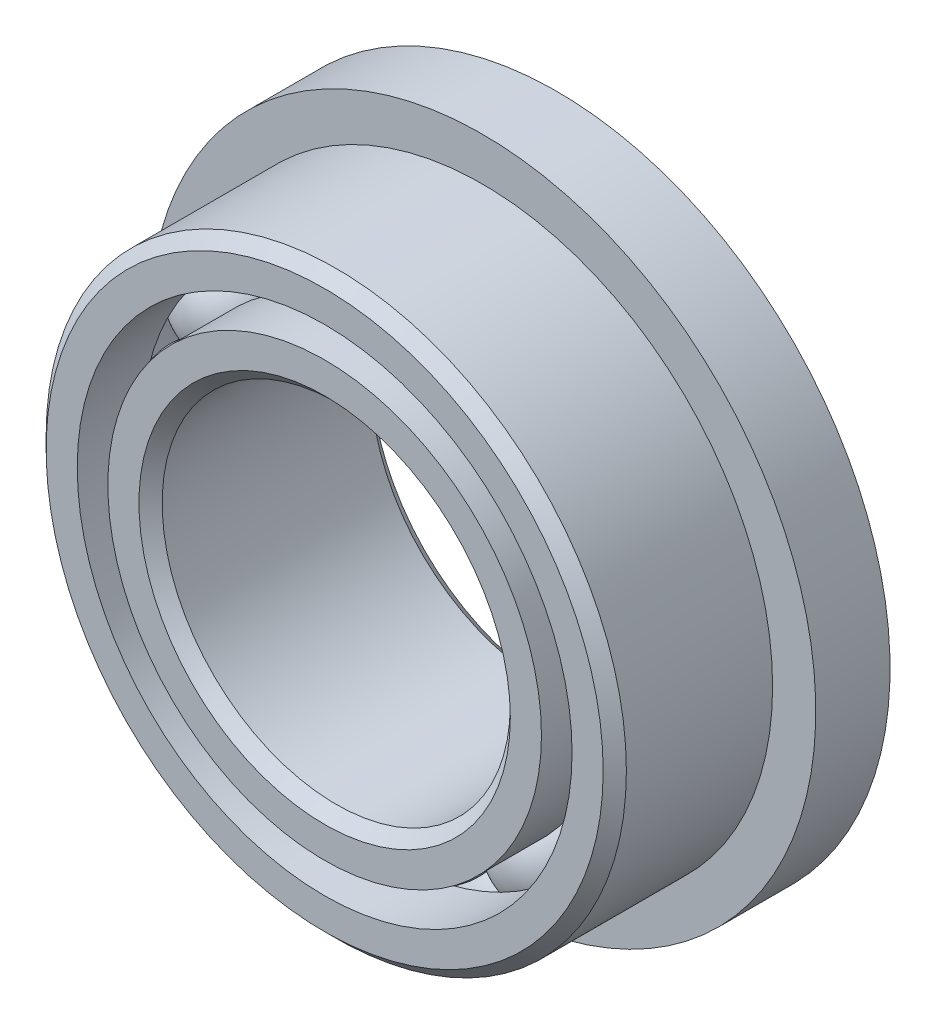
ISO-10303-21;
HEADER;
FILE_DESCRIPTION(('STEP AP214'),'2;1');
FILE_NAME('part.step','',(''),(''),'','','');
FILE_SCHEMA(('AUTOMOTIVE_DESIGN { 1 0 10303 214 1 1 1 1 }'));
ENDSEC;
DATA;
#1=APPLICATION_CONTEXT('core data for automotive mechanical design processes');
#2=APPLICATION_PROTOCOL_DEFINITION('international standard','automotive_design',2000,#1);
#3=PRODUCT_CONTEXT('',#1,'mechanical');
#4=PRODUCT('Part','Part','',(#3));
#5=PRODUCT_RELATED_PRODUCT_CATEGORY('part','',(#4));
#6=PRODUCT_DEFINITION_FORMATION('','',#4);
#7=PRODUCT_DEFINITION_CONTEXT('part definition',#1,'design');
#8=PRODUCT_DEFINITION('design','',#6,#7);
#9=PRODUCT_DEFINITION_SHAPE('','',#8);
#10=(LENGTH_UNIT() NAMED_UNIT(*) SI_UNIT(.MILLI.,.METRE.));
#11=(NAMED_UNIT(*) PLANE_ANGLE_UNIT() SI_UNIT($,.RADIAN.));
#12=(NAMED_UNIT(*) SI_UNIT($,.STERADIAN.) SOLID_ANGLE_UNIT());
#13=UNCERTAINTY_MEASURE_WITH_UNIT(LENGTH_MEASURE(1.E-05),#10,'distance_accuracy_value','');
#14=(GEOMETRIC_REPRESENTATION_CONTEXT(3) GLOBAL_UNCERTAINTY_ASSIGNED_CONTEXT((#13)) GLOBAL_UNIT_ASSIGNED_CONTEXT((#10,
#11,#12)) REPRESENTATION_CONTEXT('',''));
#15=CARTESIAN_POINT('',(0.,0.,0.));
#16=DIRECTION('',(0.,0.,1.));
#17=DIRECTION('',(1.,0.,0.));
#18=AXIS2_PLACEMENT_3D('',#15,#16,#17);
#19=CARTESIAN_POINT('',(-1.58749999999996,2.74963065701561,0.));
#20=DIRECTION('',(0.,0.,1.));
#21=DIRECTION('',(0.499999999999989,-0.866025403784445,0.));
#22=AXIS2_PLACEMENT_3D('',#19,#20,#21);
#23=SPHERICAL_SURFACE('',#22,0.735956624828183);
#24=CARTESIAN_POINT('',(-1.58749999999996,2.74963065701561,0.735956624828182));
#25=VERTEX_POINT('',#24);
#26=VERTEX_LOOP('',#25);
#27=FACE_BOUND('',#26,.T.);
#28=ADVANCED_FACE('F37',(#27),#23,.T.);
#29=CLOSED_SHELL('',(#28));
#30=MANIFOLD_SOLID_BREP('B2',#29);
#31=CARTESIAN_POINT('',(-2.74963065701557,1.58750000000003,0.));
#32=DIRECTION('',(0.,0.,1.));
#33=DIRECTION('',(0.866025403784433,-0.50000000000001,0.));
#34=AXIS2_PLACEMENT_3D('',#31,#32,#33);
#35=SPHERICAL_SURFACE('',#34,0.735956624828183);
#36=CARTESIAN_POINT('',(-2.74963065701557,1.58750000000003,0.735956624828182));
#37=VERTEX_POINT('',#36);
#38=VERTEX_LOOP('',#37);
#39=FACE_BOUND('',#38,.T.);
#40=ADVANCED_FACE('F57',(#39),#35,.T.);
#41=CLOSED_SHELL('',(#40));
#42=MANIFOLD_SOLID_BREP('B6',#41);
#43=CARTESIAN_POINT('',(-3.175,0.,0.));
#44=DIRECTION('',(0.,0.,1.));
#45=DIRECTION('',(1.,0.,0.));
#46=AXIS2_PLACEMENT_3D('',#43,#44,#45);
#47=SPHERICAL_SURFACE('',#46,0.735956624828183);
#48=CARTESIAN_POINT('',(-3.175,0.,0.735956624828182));
#49=VERTEX_POINT('',#48);
#50=VERTEX_LOOP('',#49);
#51=FACE_BOUND('',#50,.T.);
#52=ADVANCED_FACE('F77',(#51),#47,.T.);
#53=CLOSED_SHELL('',(#52));
#54=MANIFOLD_SOLID_BREP('B33',#53);
#55=CARTESIAN_POINT('',(-2.74963065701561,-1.58749999999997,0.));
#56=DIRECTION('',(0.,0.,1.));
#57=DIRECTION('',(0.866025403784443,0.499999999999992,0.));
#58=AXIS2_PLACEMENT_3D('',#55,#56,#57);
#59=SPHERICAL_SURFACE('',#58,0.735956624828183);
#60=CARTESIAN_POINT('',(-2.74963065701561,-1.58749999999997,0.735956624828182));
#61=VERTEX_POINT('',#60);
#62=VERTEX_LOOP('',#61);
#63=FACE_BOUND('',#62,.T.);
#64=ADVANCED_FACE('F97',(#63),#59,.T.);
#65=CLOSED_SHELL('',(#64));
#66=MANIFOLD_SOLID_BREP('B53',#65);
#67=CARTESIAN_POINT('',(-1.58750000000002,-2.74963065701558,0.));
#68=DIRECTION('',(0.,0.,1.));
#69=DIRECTION('',(0.500000000000007,0.866025403784435,0.));
#70=AXIS2_PLACEMENT_3D('',#67,#68,#69);
#71=SPHERICAL_SURFACE('',#70,0.735956624828183);
#72=CARTESIAN_POINT('',(-1.58750000000002,-2.74963065701558,0.735956624828182));
#73=VERTEX_POINT('',#72);
#74=VERTEX_LOOP('',#73);
#75=FACE_BOUND('',#74,.T.);
#76=ADVANCED_FACE('F117',(#75),#71,.T.);
#77=CLOSED_SHELL('',(#76));
#78=MANIFOLD_SOLID_BREP('B73',#77);
#79=CARTESIAN_POINT('',(0.,-3.175,0.));
#80=DIRECTION('',(0.,0.,1.));
#81=DIRECTION('',(0.,1.,0.));
#82=AXIS2_PLACEMENT_3D('',#79,#80,#81);
#83=SPHERICAL_SURFACE('',#82,0.735956624828183);
#84=CARTESIAN_POINT('',(0.,-3.175,0.735956624828182));
#85=VERTEX_POINT('',#84);
#86=VERTEX_LOOP('',#85);
#87=FACE_BOUND('',#86,.T.);
#88=ADVANCED_FACE('F137',(#87),#83,.T.);
#89=CLOSED_SHELL('',(#88));
#90=MANIFOLD_SOLID_BREP('B93',#89);
#91=CARTESIAN_POINT('',(1.58749999999998,-2.7496306570156,0.));
#92=DIRECTION('',(0.,0.,1.));
#93=DIRECTION('',(-0.499999999999995,0.866025403784442,0.));
#94=AXIS2_PLACEMENT_3D('',#91,#92,#93);
#95=SPHERICAL_SURFACE('',#94,0.735956624828183);
#96=CARTESIAN_POINT('',(1.58749999999998,-2.7496306570156,0.735956624828182));
#97=VERTEX_POINT('',#96);
#98=VERTEX_LOOP('',#97);
#99=FACE_BOUND('',#98,.T.);
#100=ADVANCED_FACE('F157',(#99),#95,.T.);
#101=CLOSED_SHELL('',(#100));
#102=MANIFOLD_SOLID_BREP('B113',#101);
#103=CARTESIAN_POINT('',(2.74963065701559,-1.58750000000001,0.));
#104=DIRECTION('',(0.,0.,1.));
#105=DIRECTION('',(-0.866025403784436,0.500000000000004,0.));
#106=AXIS2_PLACEMENT_3D('',#103,#104,#105);
#107=SPHERICAL_SURFACE('',#106,0.735956624828183);
#108=CARTESIAN_POINT('',(2.74963065701559,-1.58750000000001,0.735956624828182));
#109=VERTEX_POINT('',#108);
#110=VERTEX_LOOP('',#109);
#111=FACE_BOUND('',#110,.T.);
#112=ADVANCED_FACE('F177',(#111),#107,.T.);
#113=CLOSED_SHELL('',(#112));
#114=MANIFOLD_SOLID_BREP('B133',#113);
#115=CARTESIAN_POINT('',(3.175,0.,0.));
#116=DIRECTION('',(0.,0.,1.));
#117=DIRECTION('',(-1.,0.,0.));
#118=AXIS2_PLACEMENT_3D('',#115,#116,#117);
#119=SPHERICAL_SURFACE('',#118,0.735956624828183);
#120=CARTESIAN_POINT('',(3.175,0.,0.735956624828182));
#121=VERTEX_POINT('',#120);
#122=VERTEX_LOOP('',#121);
#123=FACE_BOUND('',#122,.T.);
#124=ADVANCED_FACE('F197',(#123),#119,.T.);
#125=CLOSED_SHELL('',(#124));
#126=MANIFOLD_SOLID_BREP('B153',#125);
#127=CARTESIAN_POINT('',(2.7496306570156,1.58749999999999,0.));
#128=DIRECTION('',(0.,0.,1.));
#129=DIRECTION('',(-0.86602540378444,-0.499999999999998,0.));
#130=AXIS2_PLACEMENT_3D('',#127,#128,#129);
#131=SPHERICAL_SURFACE('',#130,0.735956624828183);
#132=CARTESIAN_POINT('',(2.7496306570156,1.58749999999999,0.735956624828182));
#133=VERTEX_POINT('',#132);
#134=VERTEX_LOOP('',#133);
#135=FACE_BOUND('',#134,.T.);
#136=ADVANCED_FACE('F217',(#135),#131,.T.);
#137=CLOSED_SHELL('',(#136));
#138=MANIFOLD_SOLID_BREP('B173',#137);
#139=CARTESIAN_POINT('',(1.5875,2.74963065701559,0.));
#140=DIRECTION('',(0.,0.,1.));
#141=DIRECTION('',(-0.500000000000001,-0.866025403784438,0.));
#142=AXIS2_PLACEMENT_3D('',#139,#140,#141);
#143=SPHERICAL_SURFACE('',#142,0.735956624828183);
#144=CARTESIAN_POINT('',(1.5875,2.74963065701559,0.735956624828182));
#145=VERTEX_POINT('',#144);
#146=VERTEX_LOOP('',#145);
#147=FACE_BOUND('',#146,.T.);
#148=ADVANCED_FACE('F237',(#147),#143,.T.);
#149=CLOSED_SHELL('',(#148));
#150=MANIFOLD_SOLID_BREP('B193',#149);
#151=CARTESIAN_POINT('',(0.,3.175,0.));
#152=DIRECTION('',(0.,0.,1.));
#153=DIRECTION('',(0.,-1.,0.));
#154=AXIS2_PLACEMENT_3D('',#151,#152,#153);
#155=SPHERICAL_SURFACE('',#154,0.735956624828183);
#156=CARTESIAN_POINT('',(0.,3.175,0.735956624828182));
#157=VERTEX_POINT('',#156);
#158=VERTEX_LOOP('',#157);
#159=FACE_BOUND('',#158,.T.);
#160=ADVANCED_FACE('F260',(#159),#155,.T.);
#161=CLOSED_SHELL('',(#160));
#162=MANIFOLD_SOLID_BREP('B213',#161);
#163=CARTESIAN_POINT('',(0.,2.96565934065934,1.5875));
#164=DIRECTION('',(0.,0.,-1.));
#165=DIRECTION('',(-1.,0.,0.));
#166=AXIS2_PLACEMENT_3D('',#163,#164,#165);
#167=PLANE('',#166);
#168=CARTESIAN_POINT('',(0.,0.,1.5875));
#169=DIRECTION('',(0.,0.,1.));
#170=DIRECTION('',(1.,0.,0.));
#171=AXIS2_PLACEMENT_3D('',#168,#169,#170);
#172=CIRCLE('',#171,2.54);
#173=CARTESIAN_POINT('',(2.54,0.,1.5875));
#174=VERTEX_POINT('',#173);
#175=EDGE_CURVE('E308',#174,#174,#172,.T.);
#176=ORIENTED_EDGE('',*,*,#175,.F.);
#177=EDGE_LOOP('',(#176));
#178=FACE_BOUND('',#177,.T.);
#179=CARTESIAN_POINT('',(0.,0.,1.5875));
#180=DIRECTION('',(0.,0.,1.));
#181=DIRECTION('',(1.,0.,0.));
#182=AXIS2_PLACEMENT_3D('',#179,#180,#181);
#183=CIRCLE('',#182,2.96565934065934);
#184=CARTESIAN_POINT('',(2.96565934065934,0.,1.5875));
#185=VERTEX_POINT('',#184);
#186=EDGE_CURVE('E259',#185,#185,#183,.T.);
#187=ORIENTED_EDGE('',*,*,#186,.T.);
#188=EDGE_LOOP('',(#187));
#189=FACE_BOUND('',#188,.T.);
#190=ADVANCED_FACE('F280',(#178,#189),#167,.F.);
#191=CARTESIAN_POINT('',(0.,0.,1.5875));
#192=DIRECTION('',(0.,0.,1.));
#193=DIRECTION('',(1.,0.,0.));
#194=AXIS2_PLACEMENT_3D('',#191,#192,#193);
#195=CYLINDRICAL_SURFACE('',#194,2.96565934065934);
#196=ORIENTED_EDGE('',*,*,#186,.F.);
#197=EDGE_LOOP('',(#196));
#198=FACE_BOUND('',#197,.T.);
#199=CARTESIAN_POINT('',(0.,0.,0.705555555555555));
#200=DIRECTION('',(0.,0.,1.));
#201=DIRECTION('',(1.,0.,0.));
#202=AXIS2_PLACEMENT_3D('',#199,#200,#201);
#203=CIRCLE('',#202,2.96565934065934);
#204=CARTESIAN_POINT('',(2.96565934065934,0.,0.705555555555555));
#205=VERTEX_POINT('',#204);
#206=EDGE_CURVE('E286',#205,#205,#203,.T.);
#207=ORIENTED_EDGE('',*,*,#206,.T.);
#208=EDGE_LOOP('',(#207));
#209=FACE_BOUND('',#208,.T.);
#210=ADVANCED_FACE('F315',(#198,#209),#195,.T.);
#211=CARTESIAN_POINT('',(0.,0.,0.));
#212=DIRECTION('',(0.,0.,1.));
#213=DIRECTION('',(1.,0.,0.));
#214=AXIS2_PLACEMENT_3D('',#211,#212,#213);
#215=TOROIDAL_SURFACE('',#214,3.175,0.735956624828183);
#216=ORIENTED_EDGE('',*,*,#206,.F.);
#217=EDGE_LOOP('',(#216));
#218=FACE_BOUND('',#217,.T.);
#219=CARTESIAN_POINT('',(0.,0.,-0.705555555555556));
#220=DIRECTION('',(0.,0.,1.));
#221=DIRECTION('',(1.,0.,0.));
#222=AXIS2_PLACEMENT_3D('',#219,#220,#221);
#223=CIRCLE('',#222,2.96565934065934);
#224=CARTESIAN_POINT('',(2.96565934065934,0.,-0.705555555555556));
#225=VERTEX_POINT('',#224);
#226=EDGE_CURVE('E290',#225,#225,#223,.T.);
#227=ORIENTED_EDGE('',*,*,#226,.T.);
#228=EDGE_LOOP('',(#227));
#229=FACE_BOUND('',#228,.T.);
#230=ADVANCED_FACE('F319',(#218,#229),#215,.F.);
#231=CARTESIAN_POINT('',(0.,0.,1.5875));
#232=DIRECTION('',(0.,0.,1.));
#233=DIRECTION('',(1.,0.,0.));
#234=AXIS2_PLACEMENT_3D('',#231,#232,#233);
#235=CYLINDRICAL_SURFACE('',#234,2.96565934065934);
#236=ORIENTED_EDGE('',*,*,#226,.F.);
#237=EDGE_LOOP('',(#236));
#238=FACE_BOUND('',#237,.T.);
#239=CARTESIAN_POINT('',(0.,0.,-1.5875));
#240=DIRECTION('',(0.,0.,1.));
#241=DIRECTION('',(1.,0.,0.));
#242=AXIS2_PLACEMENT_3D('',#239,#240,#241);
#243=CIRCLE('',#242,2.96565934065934);
#244=CARTESIAN_POINT('',(2.96565934065934,0.,-1.5875));
#245=VERTEX_POINT('',#244);
#246=EDGE_CURVE('E294',#245,#245,#243,.T.);
#247=ORIENTED_EDGE('',*,*,#246,.T.);
#248=EDGE_LOOP('',(#247));
#249=FACE_BOUND('',#248,.T.);
#250=ADVANCED_FACE('F324',(#238,#249),#235,.T.);
#251=CARTESIAN_POINT('',(0.,2.54,-1.5875));
#252=DIRECTION('',(0.,0.,1.));
#253=DIRECTION('',(1.,0.,0.));
#254=AXIS2_PLACEMENT_3D('',#251,#252,#253);
#255=PLANE('',#254);
#256=ORIENTED_EDGE('',*,*,#246,.F.);
#257=EDGE_LOOP('',(#256));
#258=FACE_BOUND('',#257,.T.);
#259=CARTESIAN_POINT('',(0.,0.,-1.5875));
#260=DIRECTION('',(0.,0.,1.));
#261=DIRECTION('',(1.,0.,0.));
#262=AXIS2_PLACEMENT_3D('',#259,#260,#261);
#263=CIRCLE('',#262,2.54);
#264=CARTESIAN_POINT('',(2.54,0.,-1.5875));
#265=VERTEX_POINT('',#264);
#266=EDGE_CURVE('E299',#265,#265,#263,.T.);
#267=ORIENTED_EDGE('',*,*,#266,.T.);
#268=EDGE_LOOP('',(#267));
#269=FACE_BOUND('',#268,.T.);
#270=ADVANCED_FACE('F330',(#258,#269),#255,.F.);
#271=CARTESIAN_POINT('',(0.,0.,-1.42875));
#272=DIRECTION('',(0.,0.,-1.));
#273=DIRECTION('',(-1.,0.,0.));
#274=AXIS2_PLACEMENT_3D('',#271,#272,#273);
#275=CONICAL_SURFACE('',#274,2.38125,0.785398163397448);
#276=ORIENTED_EDGE('',*,*,#266,.F.);
#277=EDGE_LOOP('',(#276));
#278=FACE_BOUND('',#277,.T.);
#279=CARTESIAN_POINT('',(0.,0.,-1.42875));
#280=DIRECTION('',(0.,0.,1.));
#281=DIRECTION('',(1.,0.,0.));
#282=AXIS2_PLACEMENT_3D('',#279,#280,#281);
#283=CIRCLE('',#282,2.38125);
#284=CARTESIAN_POINT('',(2.38125,0.,-1.42875));
#285=VERTEX_POINT('',#284);
#286=EDGE_CURVE('E302',#285,#285,#283,.T.);
#287=ORIENTED_EDGE('',*,*,#286,.T.);
#288=EDGE_LOOP('',(#287));
#289=FACE_BOUND('',#288,.T.);
#290=ADVANCED_FACE('F334',(#278,#289),#275,.F.);
#291=CARTESIAN_POINT('',(0.,0.,1.5875));
#292=DIRECTION('',(0.,0.,1.));
#293=DIRECTION('',(1.,0.,0.));
#294=AXIS2_PLACEMENT_3D('',#291,#292,#293);
#295=CYLINDRICAL_SURFACE('',#294,2.38125);
#296=ORIENTED_EDGE('',*,*,#286,.F.);
#297=EDGE_LOOP('',(#296));
#298=FACE_BOUND('',#297,.T.);
#299=CARTESIAN_POINT('',(0.,0.,1.42875));
#300=DIRECTION('',(0.,0.,1.));
#301=DIRECTION('',(1.,0.,0.));
#302=AXIS2_PLACEMENT_3D('',#299,#300,#301);
#303=CIRCLE('',#302,2.38125);
#304=CARTESIAN_POINT('',(2.38125,0.,1.42875));
#305=VERTEX_POINT('',#304);
#306=EDGE_CURVE('E305',#305,#305,#303,.T.);
#307=ORIENTED_EDGE('',*,*,#306,.T.);
#308=EDGE_LOOP('',(#307));
#309=FACE_BOUND('',#308,.T.);
#310=ADVANCED_FACE('F338',(#298,#309),#295,.F.);
#311=CARTESIAN_POINT('',(0.,0.,1.5875));
#312=DIRECTION('',(0.,0.,1.));
#313=DIRECTION('',(1.,0.,0.));
#314=AXIS2_PLACEMENT_3D('',#311,#312,#313);
#315=CONICAL_SURFACE('',#314,2.54,0.78539816339745);
#316=ORIENTED_EDGE('',*,*,#306,.F.);
#317=EDGE_LOOP('',(#316));
#318=FACE_BOUND('',#317,.T.);
#319=ORIENTED_EDGE('',*,*,#175,.T.);
#320=EDGE_LOOP('',(#319));
#321=FACE_BOUND('',#320,.T.);
#322=ADVANCED_FACE('F312',(#318,#321),#315,.F.);
#323=CLOSED_SHELL('',(#190,#210,#230,#250,#270,#290,#310,#322));
#324=MANIFOLD_SOLID_BREP('B233',#323);
#325=CARTESIAN_POINT('',(0.,0.,0.));
#326=DIRECTION('',(0.,0.,1.));
#327=DIRECTION('',(1.,0.,0.));
#328=AXIS2_PLACEMENT_3D('',#325,#326,#327);
#329=TOROIDAL_SURFACE('',#328,3.175,0.735956624828183);
#330=CARTESIAN_POINT('',(0.,0.,-0.571500000000001));
#331=DIRECTION('',(0.,0.,1.));
#332=DIRECTION('',(1.,0.,0.));
#333=AXIS2_PLACEMENT_3D('',#330,#331,#332);
#334=CIRCLE('',#333,3.63870238691265);
#335=CARTESIAN_POINT('',(3.63870238691265,0.,-0.571500000000001));
#336=VERTEX_POINT('',#335);
#337=EDGE_CURVE('E406',#336,#336,#334,.F.);
#338=ORIENTED_EDGE('',*,*,#337,.T.);
#339=EDGE_LOOP('',(#338));
#340=FACE_BOUND('',#339,.T.);
#341=CARTESIAN_POINT('',(0.,0.,0.705555555555555));
#342=DIRECTION('',(0.,0.,1.));
#343=DIRECTION('',(1.,0.,0.));
#344=AXIS2_PLACEMENT_3D('',#341,#342,#343);
#345=CIRCLE('',#344,3.38434065934066);
#346=CARTESIAN_POINT('',(3.38434065934066,0.,0.705555555555555));
#347=VERTEX_POINT('',#346);
#348=EDGE_CURVE('E443',#347,#347,#345,.T.);
#349=ORIENTED_EDGE('',*,*,#348,.T.);
#350=EDGE_LOOP('',(#349));
#351=FACE_BOUND('',#350,.T.);
#352=ADVANCED_FACE('F402',(#340,#351),#329,.F.);
#353=CARTESIAN_POINT('',(0.,0.,1.42875));
#354=DIRECTION('',(0.,0.,-1.));
#355=DIRECTION('',(-1.,0.,0.));
#356=AXIS2_PLACEMENT_3D('',#353,#354,#355);
#357=CONICAL_SURFACE('',#356,3.96875,0.78539816339745);
#358=CARTESIAN_POINT('',(0.,0.,1.5875));
#359=DIRECTION('',(0.,0.,1.));
#360=DIRECTION('',(1.,0.,0.));
#361=AXIS2_PLACEMENT_3D('',#358,#359,#360);
#362=CIRCLE('',#361,3.81);
#363=CARTESIAN_POINT('',(3.81,0.,1.5875));
#364=VERTEX_POINT('',#363);
#365=EDGE_CURVE('E437',#364,#364,#362,.T.);
#366=ORIENTED_EDGE('',*,*,#365,.F.);
#367=EDGE_LOOP('',(#366));
#368=FACE_BOUND('',#367,.T.);
#369=CARTESIAN_POINT('',(0.,0.,1.42875));
#370=DIRECTION('',(0.,0.,1.));
#371=DIRECTION('',(1.,0.,0.));
#372=AXIS2_PLACEMENT_3D('',#369,#370,#371);
#373=CIRCLE('',#372,3.96875);
#374=CARTESIAN_POINT('',(3.96875,0.,1.42875));
#375=VERTEX_POINT('',#374);
#376=EDGE_CURVE('E279',#375,#375,#373,.T.);
#377=ORIENTED_EDGE('',*,*,#376,.T.);
#378=EDGE_LOOP('',(#377));
#379=FACE_BOUND('',#378,.T.);
#380=ADVANCED_FACE('F404',(#368,#379),#357,.T.);
#381=CARTESIAN_POINT('',(0.,0.,1.5875));
#382=DIRECTION('',(0.,0.,1.));
#383=DIRECTION('',(1.,0.,0.));
#384=AXIS2_PLACEMENT_3D('',#381,#382,#383);
#385=CYLINDRICAL_SURFACE('',#384,3.96875);
#386=CARTESIAN_POINT('',(0.,0.,-0.571500000000001));
#387=DIRECTION('',(0.,0.,1.));
#388=DIRECTION('',(1.,0.,0.));
#389=AXIS2_PLACEMENT_3D('',#386,#387,#388);
#390=CIRCLE('',#389,3.96875);
#391=CARTESIAN_POINT('',(3.96875,0.,-0.571500000000001));
#392=VERTEX_POINT('',#391);
#393=EDGE_CURVE('E424',#392,#392,#390,.T.);
#394=ORIENTED_EDGE('',*,*,#393,.T.);
#395=EDGE_LOOP('',(#394));
#396=FACE_BOUND('',#395,.T.);
#397=ORIENTED_EDGE('',*,*,#376,.F.);
#398=EDGE_LOOP('',(#397));
#399=FACE_BOUND('',#398,.T.);
#400=ADVANCED_FACE('F469',(#396,#399),#385,.T.);
#401=CARTESIAN_POINT('',(0.,0.,1.5875));
#402=DIRECTION('',(0.,0.,1.));
#403=DIRECTION('',(1.,0.,0.));
#404=AXIS2_PLACEMENT_3D('',#401,#402,#403);
#405=CYLINDRICAL_SURFACE('',#404,3.38434065934066);
#406=ORIENTED_EDGE('',*,*,#348,.F.);
#407=EDGE_LOOP('',(#406));
#408=FACE_BOUND('',#407,.T.);
#409=CARTESIAN_POINT('',(0.,0.,1.5875));
#410=DIRECTION('',(0.,0.,1.));
#411=DIRECTION('',(1.,0.,0.));
#412=AXIS2_PLACEMENT_3D('',#409,#410,#411);
#413=CIRCLE('',#412,3.38434065934066);
#414=CARTESIAN_POINT('',(3.38434065934066,0.,1.5875));
#415=VERTEX_POINT('',#414);
#416=EDGE_CURVE('E440',#415,#415,#413,.T.);
#417=ORIENTED_EDGE('',*,*,#416,.T.);
#418=EDGE_LOOP('',(#417));
#419=FACE_BOUND('',#418,.T.);
#420=ADVANCED_FACE('F475',(#408,#419),#405,.F.);
#421=CARTESIAN_POINT('',(0.,3.81,1.5875));
#422=DIRECTION('',(0.,0.,-1.));
#423=DIRECTION('',(-1.,0.,0.));
#424=AXIS2_PLACEMENT_3D('',#421,#422,#423);
#425=PLANE('',#424);
#426=ORIENTED_EDGE('',*,*,#416,.F.);
#427=EDGE_LOOP('',(#426));
#428=FACE_BOUND('',#427,.T.);
#429=ORIENTED_EDGE('',*,*,#365,.T.);
#430=EDGE_LOOP('',(#429));
#431=FACE_BOUND('',#430,.T.);
#432=ADVANCED_FACE('F478',(#428,#431),#425,.F.);
#433=CARTESIAN_POINT('',(0.,0.,-1.5875));
#434=DIRECTION('',(0.,0.,-1.));
#435=DIRECTION('',(-1.,0.,0.));
#436=AXIS2_PLACEMENT_3D('',#433,#434,#435);
#437=CYLINDRICAL_SURFACE('',#436,3.59717032967033);
#438=CARTESIAN_POINT('',(0.,0.,-0.571500000000001));
#439=DIRECTION('',(0.,0.,-1.));
#440=DIRECTION('',(-1.,0.,0.));
#441=AXIS2_PLACEMENT_3D('',#438,#439,#440);
#442=CIRCLE('',#441,3.59717032967033);
#443=CARTESIAN_POINT('',(-3.59717032967033,0.,-0.571500000000001));
#444=VERTEX_POINT('',#443);
#445=EDGE_CURVE('E431',#444,#444,#442,.T.);
#446=ORIENTED_EDGE('',*,*,#445,.F.);
#447=EDGE_LOOP('',(#446));
#448=FACE_BOUND('',#447,.T.);
#449=CARTESIAN_POINT('',(0.,0.,-0.602830296496897));
#450=DIRECTION('',(0.,0.,1.));
#451=DIRECTION('',(1.,0.,0.));
#452=AXIS2_PLACEMENT_3D('',#449,#450,#451);
#453=CIRCLE('',#452,3.59717032967033);
#454=CARTESIAN_POINT('',(3.59717032967033,0.,-0.602830296496897));
#455=VERTEX_POINT('',#454);
#456=EDGE_CURVE('E418',#455,#455,#453,.T.);
#457=ORIENTED_EDGE('',*,*,#456,.F.);
#458=EDGE_LOOP('',(#457));
#459=FACE_BOUND('',#458,.T.);
#460=ADVANCED_FACE('F483',(#448,#459),#437,.F.);
#461=CARTESIAN_POINT('',(0.,3.59717032967033,-0.571500000000001));
#462=DIRECTION('',(0.,0.,1.));
#463=DIRECTION('',(1.,0.,0.));
#464=AXIS2_PLACEMENT_3D('',#461,#462,#463);
#465=PLANE('',#464);
#466=ORIENTED_EDGE('',*,*,#445,.T.);
#467=EDGE_LOOP('',(#466));
#468=FACE_BOUND('',#467,.T.);
#469=ORIENTED_EDGE('',*,*,#337,.F.);
#470=EDGE_LOOP('',(#469));
#471=FACE_BOUND('',#470,.T.);
#472=ADVANCED_FACE('F489',(#468,#471),#465,.T.);
#473=CARTESIAN_POINT('',(0.,0.,-0.571500000000001));
#474=DIRECTION('',(0.,0.,-1.));
#475=DIRECTION('',(-1.,0.,0.));
#476=AXIS2_PLACEMENT_3D('',#473,#474,#475);
#477=CIRCLE('',#476,4.5593);
#478=CARTESIAN_POINT('',(-4.5593,0.,-0.571500000000001));
#479=VERTEX_POINT('',#478);
#480=EDGE_CURVE('E426',#479,#479,#477,.T.);
#481=ORIENTED_EDGE('',*,*,#480,.F.);
#482=EDGE_LOOP('',(#481));
#483=FACE_BOUND('',#482,.T.);
#484=ORIENTED_EDGE('',*,*,#393,.F.);
#485=EDGE_LOOP('',(#484));
#486=FACE_BOUND('',#485,.T.);
#487=ADVANCED_FACE('F495',(#483,#486),#465,.T.);
#488=CARTESIAN_POINT('',(0.,0.,-1.5875));
#489=DIRECTION('',(0.,0.,-1.));
#490=DIRECTION('',(-1.,0.,0.));
#491=AXIS2_PLACEMENT_3D('',#488,#489,#490);
#492=CYLINDRICAL_SURFACE('',#491,4.5593);
#493=ORIENTED_EDGE('',*,*,#480,.T.);
#494=EDGE_LOOP('',(#493));
#495=FACE_BOUND('',#494,.T.);
#496=CARTESIAN_POINT('',(0.,0.,-1.5875));
#497=DIRECTION('',(0.,0.,-1.));
#498=DIRECTION('',(-1.,0.,0.));
#499=AXIS2_PLACEMENT_3D('',#496,#497,#498);
#500=CIRCLE('',#499,4.5593);
#501=CARTESIAN_POINT('',(-4.5593,0.,-1.5875));
#502=VERTEX_POINT('',#501);
#503=EDGE_CURVE('E420',#502,#502,#500,.T.);
#504=ORIENTED_EDGE('',*,*,#503,.F.);
#505=EDGE_LOOP('',(#504));
#506=FACE_BOUND('',#505,.T.);
#507=ADVANCED_FACE('F460',(#495,#506),#492,.T.);
#508=CARTESIAN_POINT('',(0.,0.,1.5875));
#509=DIRECTION('',(0.,0.,1.));
#510=DIRECTION('',(1.,0.,0.));
#511=AXIS2_PLACEMENT_3D('',#508,#509,#510);
#512=CYLINDRICAL_SURFACE('',#511,3.38434065934066);
#513=CARTESIAN_POINT('',(0.,0.,-1.5875));
#514=DIRECTION('',(0.,0.,1.));
#515=DIRECTION('',(1.,0.,0.));
#516=AXIS2_PLACEMENT_3D('',#513,#514,#515);
#517=CIRCLE('',#516,3.38434065934066);
#518=CARTESIAN_POINT('',(3.38434065934066,0.,-1.5875));
#519=VERTEX_POINT('',#518);
#520=EDGE_CURVE('E410',#519,#519,#517,.T.);
#521=ORIENTED_EDGE('',*,*,#520,.F.);
#522=EDGE_LOOP('',(#521));
#523=FACE_BOUND('',#522,.T.);
#524=CARTESIAN_POINT('',(0.,0.,-0.705555555555556));
#525=DIRECTION('',(0.,0.,1.));
#526=DIRECTION('',(1.,0.,0.));
#527=AXIS2_PLACEMENT_3D('',#524,#525,#526);
#528=CIRCLE('',#527,3.38434065934066);
#529=CARTESIAN_POINT('',(3.38434065934066,0.,-0.705555555555556));
#530=VERTEX_POINT('',#529);
#531=EDGE_CURVE('E415',#530,#530,#528,.T.);
#532=ORIENTED_EDGE('',*,*,#531,.T.);
#533=EDGE_LOOP('',(#532));
#534=FACE_BOUND('',#533,.T.);
#535=ADVANCED_FACE('F448',(#523,#534),#512,.F.);
#536=ORIENTED_EDGE('',*,*,#456,.T.);
#537=EDGE_LOOP('',(#536));
#538=FACE_BOUND('',#537,.T.);
#539=ORIENTED_EDGE('',*,*,#531,.F.);
#540=EDGE_LOOP('',(#539));
#541=FACE_BOUND('',#540,.T.);
#542=ADVANCED_FACE('F450',(#538,#541),#329,.F.);
#543=CARTESIAN_POINT('',(0.,3.81,-1.5875));
#544=DIRECTION('',(0.,0.,1.));
#545=DIRECTION('',(1.,0.,0.));
#546=AXIS2_PLACEMENT_3D('',#543,#544,#545);
#547=PLANE('',#546);
#548=ORIENTED_EDGE('',*,*,#520,.T.);
#549=EDGE_LOOP('',(#548));
#550=FACE_BOUND('',#549,.T.);
#551=ORIENTED_EDGE('',*,*,#503,.T.);
#552=EDGE_LOOP('',(#551));
#553=FACE_BOUND('',#552,.T.);
#554=ADVANCED_FACE('F452',(#550,#553),#547,.F.);
#555=CLOSED_SHELL('',(#352,#380,#400,#420,#432,#460,#472,#487,#507,#535,#542,#554));
#556=MANIFOLD_SOLID_BREP('B254',#555);
#557=ADVANCED_BREP_SHAPE_REPRESENTATION('',(#18,#30,#42,#54,#66,#78,#90,#102,#114,#126,#138,
#150,#162,#324,#556),#14);
#558=SHAPE_DEFINITION_REPRESENTATION(#9,#557);
ENDSEC;
END-ISO-10303-21;
